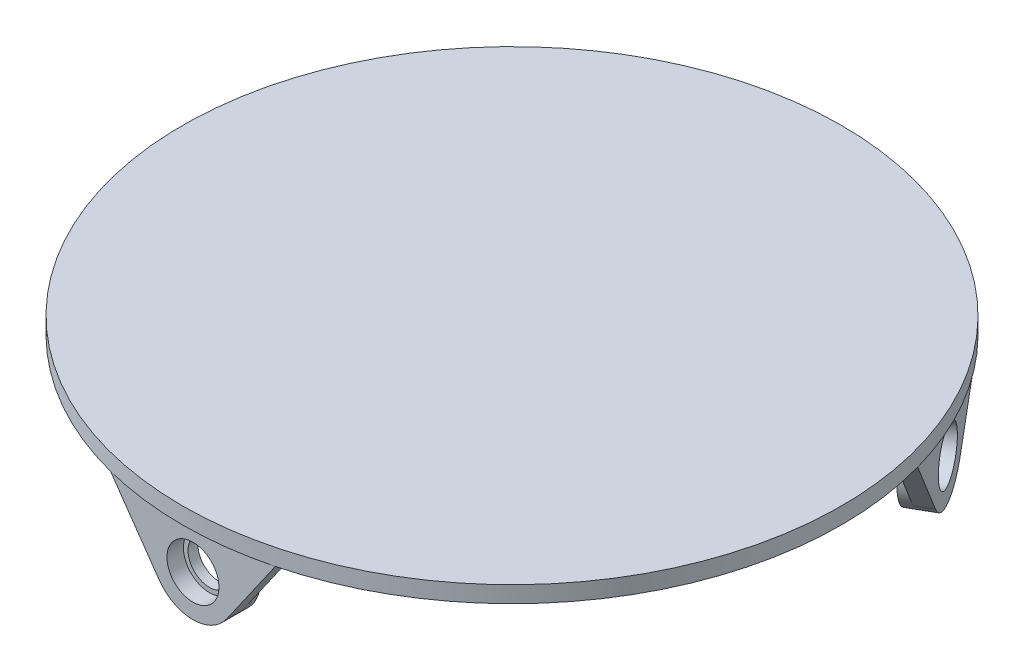
ISO-10303-21;
HEADER;
FILE_DESCRIPTION(('STEP AP214'),'2;1');
FILE_NAME('part.step','',(''),(''),'','','');
FILE_SCHEMA(('AUTOMOTIVE_DESIGN { 1 0 10303 214 1 1 1 1 }'));
ENDSEC;
DATA;
#1=APPLICATION_CONTEXT('core data for automotive mechanical design processes');
#2=APPLICATION_PROTOCOL_DEFINITION('international standard','automotive_design',2000,#1);
#3=PRODUCT_CONTEXT('',#1,'mechanical');
#4=PRODUCT('Part','Part','',(#3));
#5=PRODUCT_RELATED_PRODUCT_CATEGORY('part','',(#4));
#6=PRODUCT_DEFINITION_FORMATION('','',#4);
#7=PRODUCT_DEFINITION_CONTEXT('part definition',#1,'design');
#8=PRODUCT_DEFINITION('design','',#6,#7);
#9=PRODUCT_DEFINITION_SHAPE('','',#8);
#10=(LENGTH_UNIT() NAMED_UNIT(*) SI_UNIT(.MILLI.,.METRE.));
#11=(NAMED_UNIT(*) PLANE_ANGLE_UNIT() SI_UNIT($,.RADIAN.));
#12=(NAMED_UNIT(*) SI_UNIT($,.STERADIAN.) SOLID_ANGLE_UNIT());
#13=UNCERTAINTY_MEASURE_WITH_UNIT(LENGTH_MEASURE(1.E-05),#10,'distance_accuracy_value','');
#14=(GEOMETRIC_REPRESENTATION_CONTEXT(3) GLOBAL_UNCERTAINTY_ASSIGNED_CONTEXT((#13)) GLOBAL_UNIT_ASSIGNED_CONTEXT((#10,
#11,#12)) REPRESENTATION_CONTEXT('',''));
#15=CARTESIAN_POINT('',(0.,0.,0.));
#16=DIRECTION('',(0.,0.,1.));
#17=DIRECTION('',(1.,0.,0.));
#18=AXIS2_PLACEMENT_3D('',#15,#16,#17);
#19=CARTESIAN_POINT('',(0.,0.,0.));
#20=DIRECTION('',(0.,1.,0.));
#21=DIRECTION('',(0.,0.,1.));
#22=AXIS2_PLACEMENT_3D('',#19,#20,#21);
#23=PLANE('',#22);
#24=DIRECTION('',(-0.866025403784437,0.,0.500000000000003));
#25=VECTOR('',#24,1.);
#26=CARTESIAN_POINT('',(92.0224221373198,0.,-24.2616567329822));
#27=LINE('',#26,#25);
#28=CARTESIAN_POINT('',(96.352549156242,0.,-26.7616567329822));
#29=VERTEX_POINT('',#28);
#30=CARTESIAN_POINT('',(92.0224221373198,0.,-24.2616567329822));
#31=VERTEX_POINT('',#30);
#32=EDGE_CURVE('E196',#29,#31,#27,.T.);
#33=ORIENTED_EDGE('',*,*,#32,.F.);
#34=CARTESIAN_POINT('',(0.,0.,0.));
#35=DIRECTION('',(0.,1.,0.));
#36=DIRECTION('',(0.,0.,1.));
#37=AXIS2_PLACEMENT_3D('',#34,#35,#36);
#38=CIRCLE('',#37,100.);
#39=CARTESIAN_POINT('',(25.,0.,96.8245836551854));
#40=VERTEX_POINT('',#39);
#41=EDGE_CURVE('E49',#40,#29,#38,.T.);
#42=ORIENTED_EDGE('',*,*,#41,.F.);
#43=DIRECTION('',(0.,0.,1.));
#44=VECTOR('',#43,1.);
#45=CARTESIAN_POINT('',(25.,0.,96.8245836551854));
#46=LINE('',#45,#44);
#47=CARTESIAN_POINT('',(25.,0.,91.8245836551854));
#48=VERTEX_POINT('',#47);
#49=EDGE_CURVE('E259',#48,#40,#46,.T.);
#50=ORIENTED_EDGE('',*,*,#49,.F.);
#51=DIRECTION('',(1.,0.,0.));
#52=VECTOR('',#51,1.);
#53=CARTESIAN_POINT('',(25.,0.,91.8245836551854));
#54=LINE('',#53,#52);
#55=CARTESIAN_POINT('',(-25.,0.,91.8245836551854));
#56=VERTEX_POINT('',#55);
#57=EDGE_CURVE('E255',#56,#48,#54,.T.);
#58=ORIENTED_EDGE('',*,*,#57,.F.);
#59=DIRECTION('',(0.,0.,-1.));
#60=VECTOR('',#59,1.);
#61=CARTESIAN_POINT('',(-25.,0.,91.8245836551854));
#62=LINE('',#61,#60);
#63=CARTESIAN_POINT('',(-25.,0.,96.8245836551854));
#64=VERTEX_POINT('',#63);
#65=EDGE_CURVE('E249',#64,#56,#62,.T.);
#66=ORIENTED_EDGE('',*,*,#65,.F.);
#67=CARTESIAN_POINT('',(-96.3525491562423,0.,-26.7616567329808));
#68=VERTEX_POINT('',#67);
#69=EDGE_CURVE('E272',#68,#64,#38,.T.);
#70=ORIENTED_EDGE('',*,*,#69,.F.);
#71=DIRECTION('',(-0.866025403784443,0.,-0.499999999999993));
#72=VECTOR('',#71,1.);
#73=CARTESIAN_POINT('',(-96.3525491562424,0.,-26.7616567329808));
#74=LINE('',#73,#72);
#75=CARTESIAN_POINT('',(-92.0224221373201,0.,-24.2616567329809));
#76=VERTEX_POINT('',#75);
#77=EDGE_CURVE('E217',#76,#68,#74,.T.);
#78=ORIENTED_EDGE('',*,*,#77,.F.);
#79=DIRECTION('',(-0.499999999999992,0.,0.866025403784443));
#80=VECTOR('',#79,1.);
#81=CARTESIAN_POINT('',(-92.0224221373201,0.,-24.2616567329809));
#82=LINE('',#81,#80);
#83=CARTESIAN_POINT('',(-67.0224221373205,0.,-67.562926922203));
#84=VERTEX_POINT('',#83);
#85=EDGE_CURVE('E214',#84,#76,#82,.T.);
#86=ORIENTED_EDGE('',*,*,#85,.F.);
#87=DIRECTION('',(0.866025403784443,0.,0.499999999999993));
#88=VECTOR('',#87,1.);
#89=CARTESIAN_POINT('',(-67.0224221373205,0.,-67.562926922203));
#90=LINE('',#89,#88);
#91=CARTESIAN_POINT('',(-71.3525491562428,0.,-70.062926922203));
#92=VERTEX_POINT('',#91);
#93=EDGE_CURVE('E159',#92,#84,#90,.T.);
#94=ORIENTED_EDGE('',*,*,#93,.F.);
#95=CARTESIAN_POINT('',(71.3525491562418,0.,-70.062926922204));
#96=VERTEX_POINT('',#95);
#97=EDGE_CURVE('E283',#96,#92,#38,.T.);
#98=ORIENTED_EDGE('',*,*,#97,.F.);
#99=DIRECTION('',(0.866025403784437,0.,-0.500000000000003));
#100=VECTOR('',#99,1.);
#101=CARTESIAN_POINT('',(71.3525491562418,0.,-70.062926922204));
#102=LINE('',#101,#100);
#103=CARTESIAN_POINT('',(67.0224221373196,0.,-67.562926922204));
#104=VERTEX_POINT('',#103);
#105=EDGE_CURVE('E204',#104,#96,#102,.T.);
#106=ORIENTED_EDGE('',*,*,#105,.F.);
#107=DIRECTION('',(-0.500000000000004,0.,-0.866025403784436));
#108=VECTOR('',#107,1.);
#109=CARTESIAN_POINT('',(67.0224221373196,0.,-67.562926922204));
#110=LINE('',#109,#108);
#111=EDGE_CURVE('E199',#31,#104,#110,.T.);
#112=ORIENTED_EDGE('',*,*,#111,.F.);
#113=EDGE_LOOP('',(#33,#42,#50,#58,#66,#70,#78,#86,#94,#98,#106,#112));
#114=FACE_BOUND('',#113,.T.);
#115=ADVANCED_FACE('F45',(#114),#23,.F.);
#116=DIRECTION('',(0.500000000000004,0.,0.866025403784436));
#117=VECTOR('',#116,1.);
#118=CARTESIAN_POINT('',(96.352549156242,0.,-26.7616567329822));
#119=LINE('',#118,#117);
#120=EDGE_CURVE('E207',#96,#29,#119,.T.);
#121=ORIENTED_EDGE('',*,*,#120,.F.);
#122=EDGE_CURVE('E273',#29,#96,#38,.T.);
#123=ORIENTED_EDGE('',*,*,#122,.F.);
#124=EDGE_LOOP('',(#121,#123));
#125=FACE_BOUND('',#124,.T.);
#126=ADVANCED_FACE('F321',(#125),#23,.F.);
#127=DIRECTION('',(0.499999999999992,0.,-0.866025403784443));
#128=VECTOR('',#127,1.);
#129=CARTESIAN_POINT('',(-71.3525491562428,0.,-70.062926922203));
#130=LINE('',#129,#128);
#131=EDGE_CURVE('E200',#68,#92,#130,.T.);
#132=ORIENTED_EDGE('',*,*,#131,.F.);
#133=EDGE_CURVE('E279',#92,#68,#38,.T.);
#134=ORIENTED_EDGE('',*,*,#133,.F.);
#135=EDGE_LOOP('',(#132,#134));
#136=FACE_BOUND('',#135,.T.);
#137=ADVANCED_FACE('F294',(#136),#23,.F.);
#138=DIRECTION('',(-1.,0.,0.));
#139=VECTOR('',#138,1.);
#140=CARTESIAN_POINT('',(-25.,0.,96.8245836551854));
#141=LINE('',#140,#139);
#142=EDGE_CURVE('E262',#40,#64,#141,.T.);
#143=ORIENTED_EDGE('',*,*,#142,.F.);
#144=EDGE_CURVE('E265',#64,#40,#38,.T.);
#145=ORIENTED_EDGE('',*,*,#144,.F.);
#146=EDGE_LOOP('',(#143,#145));
#147=FACE_BOUND('',#146,.T.);
#148=ADVANCED_FACE('F311',(#147),#23,.F.);
#149=CARTESIAN_POINT('',(0.,5.,0.));
#150=DIRECTION('',(0.,-1.,0.));
#151=DIRECTION('',(0.,0.,-1.));
#152=AXIS2_PLACEMENT_3D('',#149,#150,#151);
#153=CYLINDRICAL_SURFACE('',#152,100.);
#154=CARTESIAN_POINT('',(0.,5.,0.));
#155=DIRECTION('',(0.,1.,0.));
#156=DIRECTION('',(0.,0.,1.));
#157=AXIS2_PLACEMENT_3D('',#154,#155,#156);
#158=CIRCLE('',#157,100.);
#159=CARTESIAN_POINT('',(0.,5.,100.));
#160=VERTEX_POINT('',#159);
#161=EDGE_CURVE('E11',#160,#160,#158,.T.);
#162=ORIENTED_EDGE('',*,*,#161,.F.);
#163=EDGE_LOOP('',(#162));
#164=FACE_BOUND('',#163,.T.);
#165=ORIENTED_EDGE('',*,*,#41,.T.);
#166=ORIENTED_EDGE('',*,*,#122,.T.);
#167=ORIENTED_EDGE('',*,*,#97,.T.);
#168=ORIENTED_EDGE('',*,*,#133,.T.);
#169=ORIENTED_EDGE('',*,*,#69,.T.);
#170=ORIENTED_EDGE('',*,*,#144,.T.);
#171=EDGE_LOOP('',(#165,#166,#167,#168,#169,#170));
#172=FACE_BOUND('',#171,.T.);
#173=ADVANCED_FACE('F47',(#164,#172),#153,.T.);
#174=CARTESIAN_POINT('',(0.,5.,0.));
#175=DIRECTION('',(0.,1.,0.));
#176=DIRECTION('',(0.,0.,1.));
#177=AXIS2_PLACEMENT_3D('',#174,#175,#176);
#178=PLANE('',#177);
#179=ORIENTED_EDGE('',*,*,#161,.T.);
#180=EDGE_LOOP('',(#179));
#181=FACE_BOUND('',#180,.T.);
#182=ADVANCED_FACE('F318',(#181),#178,.T.);
#183=CARTESIAN_POINT('',(25.,-30.,91.8245836551854));
#184=DIRECTION('',(0.,0.,1.));
#185=DIRECTION('',(1.,0.,0.));
#186=AXIS2_PLACEMENT_3D('',#183,#184,#185);
#187=PLANE('',#186);
#188=CARTESIAN_POINT('',(0.,-14.,91.8245836551854));
#189=DIRECTION('',(0.,0.,-1.));
#190=DIRECTION('',(-1.,0.,0.));
#191=AXIS2_PLACEMENT_3D('',#188,#189,#190);
#192=CIRCLE('',#191,12.5);
#193=CARTESIAN_POINT('',(-10.2536304257294,-21.1493400459453,91.8245836551854));
#194=VERTEX_POINT('',#193);
#195=CARTESIAN_POINT('',(10.2536304257294,-21.1493400459453,91.8245836551854));
#196=VERTEX_POINT('',#195);
#197=EDGE_CURVE('E350',#194,#196,#192,.T.);
#198=ORIENTED_EDGE('',*,*,#197,.F.);
#199=DIRECTION('',(0.571947203675623,-0.820290434058349,0.));
#200=VECTOR('',#199,1.);
#201=CARTESIAN_POINT('',(-25.,0.,91.8245836551854));
#202=LINE('',#201,#200);
#203=EDGE_CURVE('E237',#56,#194,#202,.T.);
#204=ORIENTED_EDGE('',*,*,#203,.F.);
#205=ORIENTED_EDGE('',*,*,#57,.T.);
#206=DIRECTION('',(0.571947203675623,0.820290434058349,0.));
#207=VECTOR('',#206,1.);
#208=CARTESIAN_POINT('',(25.,0.,91.8245836551854));
#209=LINE('',#208,#207);
#210=EDGE_CURVE('E241',#196,#48,#209,.T.);
#211=ORIENTED_EDGE('',*,*,#210,.F.);
#212=EDGE_LOOP('',(#198,#204,#205,#211));
#213=FACE_BOUND('',#212,.T.);
#214=ADVANCED_FACE('F349',(#213),#187,.F.);
#215=CARTESIAN_POINT('',(-25.,-30.,96.8245836551854));
#216=DIRECTION('',(0.,0.,-1.));
#217=DIRECTION('',(-1.,0.,0.));
#218=AXIS2_PLACEMENT_3D('',#215,#216,#217);
#219=PLANE('',#218);
#220=CARTESIAN_POINT('',(0.,-14.,96.8245836551854));
#221=DIRECTION('',(0.,0.,-1.));
#222=DIRECTION('',(-1.,0.,0.));
#223=AXIS2_PLACEMENT_3D('',#220,#221,#222);
#224=CIRCLE('',#223,7.89);
#225=CARTESIAN_POINT('',(-7.89,-14.,96.8245836551854));
#226=VERTEX_POINT('',#225);
#227=EDGE_CURVE('E211',#226,#226,#224,.F.);
#228=ORIENTED_EDGE('',*,*,#227,.F.);
#229=EDGE_LOOP('',(#228));
#230=FACE_BOUND('',#229,.T.);
#231=CARTESIAN_POINT('',(0.,-14.,96.8245836551854));
#232=DIRECTION('',(0.,0.,-1.));
#233=DIRECTION('',(-1.,0.,0.));
#234=AXIS2_PLACEMENT_3D('',#231,#232,#233);
#235=CIRCLE('',#234,12.5);
#236=CARTESIAN_POINT('',(10.2536304257294,-21.1493400459453,96.8245836551854));
#237=VERTEX_POINT('',#236);
#238=CARTESIAN_POINT('',(-10.2536304257294,-21.1493400459453,96.8245836551854));
#239=VERTEX_POINT('',#238);
#240=EDGE_CURVE('E230',#237,#239,#235,.T.);
#241=ORIENTED_EDGE('',*,*,#240,.F.);
#242=DIRECTION('',(-0.571947203675623,-0.820290434058349,0.));
#243=VECTOR('',#242,1.);
#244=CARTESIAN_POINT('',(25.,0.,96.8245836551854));
#245=LINE('',#244,#243);
#246=EDGE_CURVE('E233',#40,#237,#245,.T.);
#247=ORIENTED_EDGE('',*,*,#246,.F.);
#248=ORIENTED_EDGE('',*,*,#142,.T.);
#249=DIRECTION('',(-0.571947203675623,0.820290434058349,0.));
#250=VECTOR('',#249,1.);
#251=CARTESIAN_POINT('',(-25.,0.,96.8245836551854));
#252=LINE('',#251,#250);
#253=EDGE_CURVE('E226',#239,#64,#252,.T.);
#254=ORIENTED_EDGE('',*,*,#253,.F.);
#255=EDGE_LOOP('',(#241,#247,#248,#254));
#256=FACE_BOUND('',#255,.T.);
#257=ADVANCED_FACE('F355',(#230,#256),#219,.F.);
#258=CARTESIAN_POINT('',(25.,0.,100.001));
#259=DIRECTION('',(-0.820290434058349,0.571947203675623,0.));
#260=DIRECTION('',(-0.571947203675623,-0.820290434058349,0.));
#261=AXIS2_PLACEMENT_3D('',#258,#259,#260);
#262=PLANE('',#261);
#263=ORIENTED_EDGE('',*,*,#246,.T.);
#264=DIRECTION('',(0.,0.,-1.));
#265=VECTOR('',#264,1.);
#266=CARTESIAN_POINT('',(10.2536304257294,-21.1493400459453,100.001));
#267=LINE('',#266,#265);
#268=EDGE_CURVE('E245',#237,#196,#267,.T.);
#269=ORIENTED_EDGE('',*,*,#268,.T.);
#270=ORIENTED_EDGE('',*,*,#210,.T.);
#271=ORIENTED_EDGE('',*,*,#49,.T.);
#272=EDGE_LOOP('',(#263,#269,#270,#271));
#273=FACE_BOUND('',#272,.T.);
#274=ADVANCED_FACE('F358',(#273),#262,.F.);
#275=CARTESIAN_POINT('',(0.,-14.,100.001));
#276=DIRECTION('',(0.,0.,-1.));
#277=DIRECTION('',(-1.,0.,0.));
#278=AXIS2_PLACEMENT_3D('',#275,#276,#277);
#279=CYLINDRICAL_SURFACE('',#278,12.5);
#280=ORIENTED_EDGE('',*,*,#240,.T.);
#281=DIRECTION('',(0.,0.,-1.));
#282=VECTOR('',#281,1.);
#283=CARTESIAN_POINT('',(-10.2536304257294,-21.1493400459453,100.001));
#284=LINE('',#283,#282);
#285=EDGE_CURVE('E244',#239,#194,#284,.T.);
#286=ORIENTED_EDGE('',*,*,#285,.T.);
#287=ORIENTED_EDGE('',*,*,#197,.T.);
#288=ORIENTED_EDGE('',*,*,#268,.F.);
#289=EDGE_LOOP('',(#280,#286,#287,#288));
#290=FACE_BOUND('',#289,.T.);
#291=CARTESIAN_POINT('',(0.,-14.,88.8245836551854));
#292=DIRECTION('',(0.,0.,-1.));
#293=DIRECTION('',(-1.,0.,0.));
#294=AXIS2_PLACEMENT_3D('',#291,#292,#293);
#295=CIRCLE('',#294,12.5);
#296=CARTESIAN_POINT('',(-12.5,-14.,88.8245836551854));
#297=VERTEX_POINT('',#296);
#298=EDGE_CURVE('E647',#297,#297,#295,.T.);
#299=ORIENTED_EDGE('',*,*,#298,.F.);
#300=EDGE_LOOP('',(#299));
#301=FACE_BOUND('',#300,.T.);
#302=ADVANCED_FACE('F356',(#290,#301),#279,.T.);
#303=CARTESIAN_POINT('',(-25.,0.,100.001));
#304=DIRECTION('',(0.820290434058349,0.571947203675623,0.));
#305=DIRECTION('',(-0.571947203675623,0.820290434058349,0.));
#306=AXIS2_PLACEMENT_3D('',#303,#304,#305);
#307=PLANE('',#306);
#308=ORIENTED_EDGE('',*,*,#253,.T.);
#309=ORIENTED_EDGE('',*,*,#65,.T.);
#310=ORIENTED_EDGE('',*,*,#203,.T.);
#311=ORIENTED_EDGE('',*,*,#285,.F.);
#312=EDGE_LOOP('',(#308,#309,#310,#311));
#313=FACE_BOUND('',#312,.T.);
#314=ADVANCED_FACE('F352',(#313),#307,.F.);
#315=CARTESIAN_POINT('',(0.,-14.,100.001));
#316=DIRECTION('',(0.,0.,-1.));
#317=DIRECTION('',(-1.,0.,0.));
#318=AXIS2_PLACEMENT_3D('',#315,#316,#317);
#319=CYLINDRICAL_SURFACE('',#318,7.89);
#320=CARTESIAN_POINT('',(0.,-14.,91.8245836551854));
#321=DIRECTION('',(0.,0.,-1.));
#322=DIRECTION('',(-1.,0.,0.));
#323=AXIS2_PLACEMENT_3D('',#320,#321,#322);
#324=CIRCLE('',#323,7.89);
#325=CARTESIAN_POINT('',(-7.89,-14.,91.8245836551854));
#326=VERTEX_POINT('',#325);
#327=EDGE_CURVE('E644',#326,#326,#324,.F.);
#328=ORIENTED_EDGE('',*,*,#327,.F.);
#329=EDGE_LOOP('',(#328));
#330=FACE_BOUND('',#329,.T.);
#331=ORIENTED_EDGE('',*,*,#227,.T.);
#332=EDGE_LOOP('',(#331));
#333=FACE_BOUND('',#332,.T.);
#334=ADVANCED_FACE('F369',(#330,#333),#319,.F.);
#335=CARTESIAN_POINT('',(-92.0224221373201,-30.,-24.2616567329809));
#336=DIRECTION('',(-0.866025403784443,0.,-0.499999999999992));
#337=DIRECTION('',(-0.499999999999992,0.,0.866025403784443));
#338=AXIS2_PLACEMENT_3D('',#335,#336,#337);
#339=PLANE('',#338);
#340=CARTESIAN_POINT('',(-79.5224221373203,-14.,-45.912291827592));
#341=DIRECTION('',(0.866025403784443,0.,0.499999999999992));
#342=DIRECTION('',(0.499999999999992,0.,-0.866025403784443));
#343=AXIS2_PLACEMENT_3D('',#340,#341,#342);
#344=CIRCLE('',#343,12.5);
#345=CARTESIAN_POINT('',(-74.3956069244557,-21.1493400459453,-54.7921962572907));
#346=VERTEX_POINT('',#345);
#347=CARTESIAN_POINT('',(-84.6492373501849,-21.1493400459453,-37.0323873978932));
#348=VERTEX_POINT('',#347);
#349=EDGE_CURVE('E137',#346,#348,#344,.T.);
#350=ORIENTED_EDGE('',*,*,#349,.F.);
#351=DIRECTION('',(-0.285973601837807,-0.820290434058349,0.495320808006565));
#352=VECTOR('',#351,1.);
#353=CARTESIAN_POINT('',(-67.0224221373205,0.,-67.562926922203));
#354=LINE('',#353,#352);
#355=EDGE_CURVE('E141',#84,#346,#354,.T.);
#356=ORIENTED_EDGE('',*,*,#355,.F.);
#357=ORIENTED_EDGE('',*,*,#85,.T.);
#358=DIRECTION('',(-0.285973601837807,0.820290434058349,0.495320808006565));
#359=VECTOR('',#358,1.);
#360=CARTESIAN_POINT('',(-92.0224221373201,0.,-24.2616567329809));
#361=LINE('',#360,#359);
#362=EDGE_CURVE('E143',#348,#76,#361,.T.);
#363=ORIENTED_EDGE('',*,*,#362,.F.);
#364=EDGE_LOOP('',(#350,#356,#357,#363));
#365=FACE_BOUND('',#364,.T.);
#366=ADVANCED_FACE('F138',(#365),#339,.F.);
#367=CARTESIAN_POINT('',(-71.3525491562428,-30.,-70.062926922203));
#368=DIRECTION('',(0.866025403784443,0.,0.499999999999992));
#369=DIRECTION('',(0.499999999999992,0.,-0.866025403784443));
#370=AXIS2_PLACEMENT_3D('',#367,#368,#369);
#371=PLANE('',#370);
#372=CARTESIAN_POINT('',(-83.8525491562426,-14.,-48.4122918275919));
#373=DIRECTION('',(0.866025403784443,0.,0.499999999999992));
#374=DIRECTION('',(0.499999999999992,0.,-0.866025403784443));
#375=AXIS2_PLACEMENT_3D('',#372,#373,#374);
#376=CIRCLE('',#375,7.89);
#377=CARTESIAN_POINT('',(-79.9075491562426,-14.,-55.2452322634512));
#378=VERTEX_POINT('',#377);
#379=EDGE_CURVE('E646',#378,#378,#376,.F.);
#380=ORIENTED_EDGE('',*,*,#379,.F.);
#381=EDGE_LOOP('',(#380));
#382=FACE_BOUND('',#381,.T.);
#383=CARTESIAN_POINT('',(-83.8525491562426,-14.,-48.4122918275919));
#384=DIRECTION('',(0.866025403784443,0.,0.499999999999992));
#385=DIRECTION('',(0.499999999999992,0.,-0.866025403784443));
#386=AXIS2_PLACEMENT_3D('',#383,#384,#385);
#387=CIRCLE('',#386,12.5);
#388=CARTESIAN_POINT('',(-88.9793643691072,-21.1493400459453,-39.5323873978932));
#389=VERTEX_POINT('',#388);
#390=CARTESIAN_POINT('',(-78.725733943378,-21.1493400459453,-57.2921962572907));
#391=VERTEX_POINT('',#390);
#392=EDGE_CURVE('E61',#389,#391,#387,.T.);
#393=ORIENTED_EDGE('',*,*,#392,.F.);
#394=DIRECTION('',(0.285973601837807,-0.820290434058349,-0.495320808006565));
#395=VECTOR('',#394,1.);
#396=CARTESIAN_POINT('',(-96.3525491562424,0.,-26.7616567329808));
#397=LINE('',#396,#395);
#398=EDGE_CURVE('E161',#68,#389,#397,.T.);
#399=ORIENTED_EDGE('',*,*,#398,.F.);
#400=ORIENTED_EDGE('',*,*,#131,.T.);
#401=DIRECTION('',(0.285973601837807,0.820290434058349,-0.495320808006565));
#402=VECTOR('',#401,1.);
#403=CARTESIAN_POINT('',(-71.3525491562428,0.,-70.062926922203));
#404=LINE('',#403,#402);
#405=EDGE_CURVE('E302',#391,#92,#404,.T.);
#406=ORIENTED_EDGE('',*,*,#405,.F.);
#407=EDGE_LOOP('',(#393,#399,#400,#406));
#408=FACE_BOUND('',#407,.T.);
#409=ADVANCED_FACE('F301',(#382,#408),#371,.F.);
#410=CARTESIAN_POINT('',(67.0224221373196,-30.,-67.562926922204));
#411=DIRECTION('',(0.866025403784436,0.,-0.500000000000004));
#412=DIRECTION('',(-0.500000000000004,0.,-0.866025403784436));
#413=AXIS2_PLACEMENT_3D('',#410,#411,#412);
#414=PLANE('',#413);
#415=CARTESIAN_POINT('',(79.5224221373197,-14.,-45.9122918275931));
#416=DIRECTION('',(-0.866025403784436,0.,0.500000000000004));
#417=DIRECTION('',(0.500000000000004,0.,0.866025403784436));
#418=AXIS2_PLACEMENT_3D('',#415,#416,#417);
#419=CIRCLE('',#418,12.5);
#420=CARTESIAN_POINT('',(84.6492373501844,-21.1493400459453,-37.0323873978944));
#421=VERTEX_POINT('',#420);
#422=CARTESIAN_POINT('',(74.395606924455,-21.1493400459453,-54.7921962572917));
#423=VERTEX_POINT('',#422);
#424=EDGE_CURVE('E343',#421,#423,#419,.T.);
#425=ORIENTED_EDGE('',*,*,#424,.F.);
#426=DIRECTION('',(-0.285973601837814,-0.820290434058349,-0.495320808006561));
#427=VECTOR('',#426,1.);
#428=CARTESIAN_POINT('',(92.0224221373198,0.,-24.2616567329822));
#429=LINE('',#428,#427);
#430=EDGE_CURVE('E182',#31,#421,#429,.T.);
#431=ORIENTED_EDGE('',*,*,#430,.F.);
#432=ORIENTED_EDGE('',*,*,#111,.T.);
#433=DIRECTION('',(-0.285973601837814,0.820290434058349,-0.495320808006561));
#434=VECTOR('',#433,1.);
#435=CARTESIAN_POINT('',(67.0224221373196,0.,-67.562926922204));
#436=LINE('',#435,#434);
#437=EDGE_CURVE('E186',#423,#104,#436,.T.);
#438=ORIENTED_EDGE('',*,*,#437,.F.);
#439=EDGE_LOOP('',(#425,#431,#432,#438));
#440=FACE_BOUND('',#439,.T.);
#441=ADVANCED_FACE('F342',(#440),#414,.F.);
#442=CARTESIAN_POINT('',(96.352549156242,-30.,-26.7616567329822));
#443=DIRECTION('',(-0.866025403784436,0.,0.500000000000004));
#444=DIRECTION('',(0.500000000000004,0.,0.866025403784436));
#445=AXIS2_PLACEMENT_3D('',#442,#443,#444);
#446=PLANE('',#445);
#447=CARTESIAN_POINT('',(83.8525491562419,-14.,-48.4122918275931));
#448=DIRECTION('',(-0.866025403784436,0.,0.500000000000004));
#449=DIRECTION('',(0.500000000000004,0.,0.866025403784436));
#450=AXIS2_PLACEMENT_3D('',#447,#448,#449);
#451=CIRCLE('',#450,7.89);
#452=CARTESIAN_POINT('',(87.797549156242,-14.,-41.5793513917339));
#453=VERTEX_POINT('',#452);
#454=EDGE_CURVE('E171',#453,#453,#451,.F.);
#455=ORIENTED_EDGE('',*,*,#454,.F.);
#456=EDGE_LOOP('',(#455));
#457=FACE_BOUND('',#456,.T.);
#458=CARTESIAN_POINT('',(83.8525491562419,-14.,-48.4122918275931));
#459=DIRECTION('',(-0.866025403784436,0.,0.500000000000004));
#460=DIRECTION('',(0.500000000000004,0.,0.866025403784436));
#461=AXIS2_PLACEMENT_3D('',#458,#459,#460);
#462=CIRCLE('',#461,12.5);
#463=CARTESIAN_POINT('',(78.7257339433772,-21.1493400459453,-57.2921962572918));
#464=VERTEX_POINT('',#463);
#465=CARTESIAN_POINT('',(88.9793643691066,-21.1493400459453,-39.5323873978945));
#466=VERTEX_POINT('',#465);
#467=EDGE_CURVE('E69',#464,#466,#462,.T.);
#468=ORIENTED_EDGE('',*,*,#467,.F.);
#469=DIRECTION('',(0.285973601837814,-0.820290434058349,0.495320808006561));
#470=VECTOR('',#469,1.);
#471=CARTESIAN_POINT('',(71.3525491562418,0.,-70.062926922204));
#472=LINE('',#471,#470);
#473=EDGE_CURVE('E178',#96,#464,#472,.T.);
#474=ORIENTED_EDGE('',*,*,#473,.F.);
#475=ORIENTED_EDGE('',*,*,#120,.T.);
#476=DIRECTION('',(0.285973601837814,0.820290434058349,0.495320808006561));
#477=VECTOR('',#476,1.);
#478=CARTESIAN_POINT('',(96.352549156242,0.,-26.7616567329822));
#479=LINE('',#478,#477);
#480=EDGE_CURVE('E173',#466,#29,#479,.T.);
#481=ORIENTED_EDGE('',*,*,#480,.F.);
#482=EDGE_LOOP('',(#468,#474,#475,#481));
#483=FACE_BOUND('',#482,.T.);
#484=ADVANCED_FACE('F335',(#457,#483),#446,.F.);
#485=CARTESIAN_POINT('',(105.802453201924,0.,-89.9525882965354));
#486=DIRECTION('',(0.410145217029178,0.571947203675624,0.710392354375892));
#487=DIRECTION('',(0.,-0.778921706529271,0.627121180552474));
#488=AXIS2_PLACEMENT_3D('',#485,#486,#487);
#489=PLANE('',#488);
#490=ORIENTED_EDGE('',*,*,#473,.T.);
#491=DIRECTION('',(-0.866025403784436,0.,0.500000000000004));
#492=VECTOR('',#491,1.);
#493=CARTESIAN_POINT('',(113.175637989059,-21.1493400459453,-77.1818576316231));
#494=LINE('',#493,#492);
#495=EDGE_CURVE('E190',#464,#423,#494,.T.);
#496=ORIENTED_EDGE('',*,*,#495,.T.);
#497=ORIENTED_EDGE('',*,*,#437,.T.);
#498=ORIENTED_EDGE('',*,*,#105,.T.);
#499=EDGE_LOOP('',(#490,#496,#497,#498));
#500=FACE_BOUND('',#499,.T.);
#501=ADVANCED_FACE('F337',(#500),#489,.F.);
#502=CARTESIAN_POINT('',(118.302453201924,-14.,-68.3019532019245));
#503=DIRECTION('',(-0.866025403784436,0.,0.500000000000004));
#504=DIRECTION('',(0.500000000000004,0.,0.866025403784436));
#505=AXIS2_PLACEMENT_3D('',#502,#503,#504);
#506=CYLINDRICAL_SURFACE('',#505,12.5);
#507=ORIENTED_EDGE('',*,*,#467,.T.);
#508=DIRECTION('',(-0.866025403784436,0.,0.500000000000004));
#509=VECTOR('',#508,1.);
#510=CARTESIAN_POINT('',(123.429268414788,-21.1493400459453,-59.4220487722258));
#511=LINE('',#510,#509);
#512=EDGE_CURVE('E189',#466,#421,#511,.T.);
#513=ORIENTED_EDGE('',*,*,#512,.T.);
#514=ORIENTED_EDGE('',*,*,#424,.T.);
#515=ORIENTED_EDGE('',*,*,#495,.F.);
#516=EDGE_LOOP('',(#507,#513,#514,#515));
#517=FACE_BOUND('',#516,.T.);
#518=CARTESIAN_POINT('',(76.9243459259664,-14.,-44.4122918275931));
#519=DIRECTION('',(-0.866025403784436,0.,0.500000000000004));
#520=DIRECTION('',(0.500000000000004,0.,0.866025403784436));
#521=AXIS2_PLACEMENT_3D('',#518,#519,#520);
#522=CIRCLE('',#521,12.5);
#523=CARTESIAN_POINT('',(83.1743459259664,-14.,-33.5869742802876));
#524=VERTEX_POINT('',#523);
#525=EDGE_CURVE('E679',#524,#524,#522,.T.);
#526=ORIENTED_EDGE('',*,*,#525,.F.);
#527=EDGE_LOOP('',(#526));
#528=FACE_BOUND('',#527,.T.);
#529=ADVANCED_FACE('F486',(#517,#528),#506,.T.);
#530=CARTESIAN_POINT('',(130.802453201924,0.,-46.6513181073136));
#531=DIRECTION('',(-0.410145217029178,0.571947203675624,-0.710392354375892));
#532=DIRECTION('',(0.,0.778921706529271,0.627121180552474));
#533=AXIS2_PLACEMENT_3D('',#530,#531,#532);
#534=PLANE('',#533);
#535=ORIENTED_EDGE('',*,*,#480,.T.);
#536=ORIENTED_EDGE('',*,*,#32,.T.);
#537=ORIENTED_EDGE('',*,*,#430,.T.);
#538=ORIENTED_EDGE('',*,*,#512,.F.);
#539=EDGE_LOOP('',(#535,#536,#537,#538));
#540=FACE_BOUND('',#539,.T.);
#541=ADVANCED_FACE('F345',(#540),#534,.F.);
#542=CARTESIAN_POINT('',(118.302453201924,-14.,-68.3019532019245));
#543=DIRECTION('',(-0.866025403784436,0.,0.500000000000004));
#544=DIRECTION('',(0.500000000000004,0.,0.866025403784436));
#545=AXIS2_PLACEMENT_3D('',#542,#543,#544);
#546=CYLINDRICAL_SURFACE('',#545,7.89);
#547=CARTESIAN_POINT('',(79.5224221373197,-14.,-45.9122918275931));
#548=DIRECTION('',(-0.866025403784436,0.,0.500000000000004));
#549=DIRECTION('',(0.500000000000004,0.,0.866025403784436));
#550=AXIS2_PLACEMENT_3D('',#547,#548,#549);
#551=CIRCLE('',#550,7.89);
#552=CARTESIAN_POINT('',(83.4674221373198,-14.,-39.0793513917339));
#553=VERTEX_POINT('',#552);
#554=EDGE_CURVE('E669',#553,#553,#551,.F.);
#555=ORIENTED_EDGE('',*,*,#554,.F.);
#556=EDGE_LOOP('',(#555));
#557=FACE_BOUND('',#556,.T.);
#558=ORIENTED_EDGE('',*,*,#454,.T.);
#559=EDGE_LOOP('',(#558));
#560=FACE_BOUND('',#559,.T.);
#561=ADVANCED_FACE('F507',(#557,#560),#546,.F.);
#562=CARTESIAN_POINT('',(-118.302453201924,-14.,-68.3019532019226));
#563=DIRECTION('',(0.866025403784443,0.,0.499999999999992));
#564=DIRECTION('',(0.499999999999992,0.,-0.866025403784443));
#565=AXIS2_PLACEMENT_3D('',#562,#563,#564);
#566=CYLINDRICAL_SURFACE('',#565,7.89);
#567=CARTESIAN_POINT('',(-79.5224221373203,-14.,-45.912291827592));
#568=DIRECTION('',(0.866025403784443,0.,0.499999999999992));
#569=DIRECTION('',(0.499999999999992,0.,-0.866025403784443));
#570=AXIS2_PLACEMENT_3D('',#567,#568,#569);
#571=CIRCLE('',#570,7.89);
#572=CARTESIAN_POINT('',(-75.5774221373204,-14.,-52.7452322634512));
#573=VERTEX_POINT('',#572);
#574=EDGE_CURVE('E676',#573,#573,#571,.F.);
#575=ORIENTED_EDGE('',*,*,#574,.F.);
#576=EDGE_LOOP('',(#575));
#577=FACE_BOUND('',#576,.T.);
#578=ORIENTED_EDGE('',*,*,#379,.T.);
#579=EDGE_LOOP('',(#578));
#580=FACE_BOUND('',#579,.T.);
#581=ADVANCED_FACE('F516',(#577,#580),#566,.F.);
#582=CARTESIAN_POINT('',(-130.802453201924,0.,-46.6513181073115));
#583=DIRECTION('',(0.410145217029168,0.571947203675623,-0.710392354375898));
#584=DIRECTION('',(0.,0.778921706529273,0.627121180552471));
#585=AXIS2_PLACEMENT_3D('',#582,#583,#584);
#586=PLANE('',#585);
#587=ORIENTED_EDGE('',*,*,#398,.T.);
#588=DIRECTION('',(0.866025403784443,0.,0.499999999999992));
#589=VECTOR('',#588,1.);
#590=CARTESIAN_POINT('',(-123.429268414789,-21.1493400459453,-59.4220487722238));
#591=LINE('',#590,#589);
#592=EDGE_CURVE('E155',#389,#348,#591,.T.);
#593=ORIENTED_EDGE('',*,*,#592,.T.);
#594=ORIENTED_EDGE('',*,*,#362,.T.);
#595=ORIENTED_EDGE('',*,*,#77,.T.);
#596=EDGE_LOOP('',(#587,#593,#594,#595));
#597=FACE_BOUND('',#596,.T.);
#598=ADVANCED_FACE('F304',(#597),#586,.F.);
#599=CARTESIAN_POINT('',(-118.302453201924,-14.,-68.3019532019226));
#600=DIRECTION('',(0.866025403784443,0.,0.499999999999992));
#601=DIRECTION('',(0.499999999999992,0.,-0.866025403784443));
#602=AXIS2_PLACEMENT_3D('',#599,#600,#601);
#603=CYLINDRICAL_SURFACE('',#602,12.5);
#604=ORIENTED_EDGE('',*,*,#392,.T.);
#605=DIRECTION('',(0.866025403784443,0.,0.499999999999992));
#606=VECTOR('',#605,1.);
#607=CARTESIAN_POINT('',(-113.17563798906,-21.1493400459453,-77.1818576316213));
#608=LINE('',#607,#606);
#609=EDGE_CURVE('E149',#391,#346,#608,.T.);
#610=ORIENTED_EDGE('',*,*,#609,.T.);
#611=ORIENTED_EDGE('',*,*,#349,.T.);
#612=ORIENTED_EDGE('',*,*,#592,.F.);
#613=EDGE_LOOP('',(#604,#610,#611,#612));
#614=FACE_BOUND('',#613,.T.);
#615=CARTESIAN_POINT('',(-76.924345925967,-14.,-44.412291827592));
#616=DIRECTION('',(0.866025403784443,0.,0.499999999999992));
#617=DIRECTION('',(0.499999999999992,0.,-0.866025403784443));
#618=AXIS2_PLACEMENT_3D('',#615,#616,#617);
#619=CIRCLE('',#618,12.5);
#620=CARTESIAN_POINT('',(-70.6743459259671,-14.,-55.2376093748975));
#621=VERTEX_POINT('',#620);
#622=EDGE_CURVE('E146',#621,#621,#619,.T.);
#623=ORIENTED_EDGE('',*,*,#622,.F.);
#624=EDGE_LOOP('',(#623));
#625=FACE_BOUND('',#624,.T.);
#626=ADVANCED_FACE('F150',(#614,#625),#603,.T.);
#627=CARTESIAN_POINT('',(-105.802453201924,0.,-89.9525882965336));
#628=DIRECTION('',(-0.410145217029168,0.571947203675623,0.710392354375898));
#629=DIRECTION('',(0.,-0.778921706529273,0.627121180552471));
#630=AXIS2_PLACEMENT_3D('',#627,#628,#629);
#631=PLANE('',#630);
#632=ORIENTED_EDGE('',*,*,#405,.T.);
#633=ORIENTED_EDGE('',*,*,#93,.T.);
#634=ORIENTED_EDGE('',*,*,#355,.T.);
#635=ORIENTED_EDGE('',*,*,#609,.F.);
#636=EDGE_LOOP('',(#632,#633,#634,#635));
#637=FACE_BOUND('',#636,.T.);
#638=ADVANCED_FACE('F157',(#637),#631,.F.);
#639=CARTESIAN_POINT('',(0.,-14.,91.8245836551854));
#640=DIRECTION('',(0.,0.,-1.));
#641=DIRECTION('',(-1.,0.,0.));
#642=AXIS2_PLACEMENT_3D('',#639,#640,#641);
#643=PLANE('',#642);
#644=CARTESIAN_POINT('',(0.,-14.,91.8245836551854));
#645=DIRECTION('',(0.,0.,-1.));
#646=DIRECTION('',(-1.,0.,0.));
#647=AXIS2_PLACEMENT_3D('',#644,#645,#646);
#648=CIRCLE('',#647,6.5);
#649=CARTESIAN_POINT('',(-6.5,-14.,91.8245836551854));
#650=VERTEX_POINT('',#649);
#651=EDGE_CURVE('E641',#650,#650,#648,.T.);
#652=ORIENTED_EDGE('',*,*,#651,.T.);
#653=EDGE_LOOP('',(#652));
#654=FACE_BOUND('',#653,.T.);
#655=ORIENTED_EDGE('',*,*,#327,.T.);
#656=EDGE_LOOP('',(#655));
#657=FACE_BOUND('',#656,.T.);
#658=ADVANCED_FACE('F549',(#654,#657),#643,.F.);
#659=CARTESIAN_POINT('',(0.,-14.,88.8245836551854));
#660=DIRECTION('',(0.,0.,-1.));
#661=DIRECTION('',(-1.,0.,0.));
#662=AXIS2_PLACEMENT_3D('',#659,#660,#661);
#663=PLANE('',#662);
#664=ORIENTED_EDGE('',*,*,#298,.T.);
#665=EDGE_LOOP('',(#664));
#666=FACE_BOUND('',#665,.T.);
#667=CARTESIAN_POINT('',(0.,-14.,88.8245836551854));
#668=DIRECTION('',(0.,0.,-1.));
#669=DIRECTION('',(-1.,0.,0.));
#670=AXIS2_PLACEMENT_3D('',#667,#668,#669);
#671=CIRCLE('',#670,6.5);
#672=CARTESIAN_POINT('',(-6.5,-14.,88.8245836551854));
#673=VERTEX_POINT('',#672);
#674=EDGE_CURVE('E665',#673,#673,#671,.T.);
#675=ORIENTED_EDGE('',*,*,#674,.F.);
#676=EDGE_LOOP('',(#675));
#677=FACE_BOUND('',#676,.T.);
#678=ADVANCED_FACE('F618',(#666,#677),#663,.T.);
#679=CARTESIAN_POINT('',(0.,-14.,88.8245836551854));
#680=DIRECTION('',(0.,0.,1.));
#681=DIRECTION('',(1.,0.,0.));
#682=AXIS2_PLACEMENT_3D('',#679,#680,#681);
#683=CYLINDRICAL_SURFACE('',#682,6.5);
#684=ORIENTED_EDGE('',*,*,#674,.T.);
#685=EDGE_LOOP('',(#684));
#686=FACE_BOUND('',#685,.T.);
#687=ORIENTED_EDGE('',*,*,#651,.F.);
#688=EDGE_LOOP('',(#687));
#689=FACE_BOUND('',#688,.T.);
#690=ADVANCED_FACE('F560',(#686,#689),#683,.F.);
#691=CARTESIAN_POINT('',(-79.5224221373203,-14.,-45.912291827592));
#692=DIRECTION('',(0.866025403784443,0.,0.499999999999992));
#693=DIRECTION('',(0.499999999999992,0.,-0.866025403784443));
#694=AXIS2_PLACEMENT_3D('',#691,#692,#693);
#695=PLANE('',#694);
#696=CARTESIAN_POINT('',(-79.5224221373203,-14.,-45.912291827592));
#697=DIRECTION('',(0.866025403784443,0.,0.499999999999992));
#698=DIRECTION('',(0.499999999999992,0.,-0.866025403784443));
#699=AXIS2_PLACEMENT_3D('',#696,#697,#698);
#700=CIRCLE('',#699,6.5);
#701=CARTESIAN_POINT('',(-76.2724221373204,-14.,-51.5414569521909));
#702=VERTEX_POINT('',#701);
#703=EDGE_CURVE('E685',#702,#702,#700,.T.);
#704=ORIENTED_EDGE('',*,*,#703,.T.);
#705=EDGE_LOOP('',(#704));
#706=FACE_BOUND('',#705,.T.);
#707=ORIENTED_EDGE('',*,*,#574,.T.);
#708=EDGE_LOOP('',(#707));
#709=FACE_BOUND('',#708,.T.);
#710=ADVANCED_FACE('F556',(#706,#709),#695,.F.);
#711=CARTESIAN_POINT('',(-76.924345925967,-14.,-44.412291827592));
#712=DIRECTION('',(0.866025403784443,0.,0.499999999999992));
#713=DIRECTION('',(0.499999999999992,0.,-0.866025403784443));
#714=AXIS2_PLACEMENT_3D('',#711,#712,#713);
#715=PLANE('',#714);
#716=ORIENTED_EDGE('',*,*,#622,.T.);
#717=EDGE_LOOP('',(#716));
#718=FACE_BOUND('',#717,.T.);
#719=CARTESIAN_POINT('',(-76.924345925967,-14.,-44.412291827592));
#720=DIRECTION('',(0.866025403784443,0.,0.499999999999992));
#721=DIRECTION('',(0.499999999999992,0.,-0.866025403784443));
#722=AXIS2_PLACEMENT_3D('',#719,#720,#721);
#723=CIRCLE('',#722,6.5);
#724=CARTESIAN_POINT('',(-73.6743459259671,-14.,-50.0414569521909));
#725=VERTEX_POINT('',#724);
#726=EDGE_CURVE('E147',#725,#725,#723,.T.);
#727=ORIENTED_EDGE('',*,*,#726,.F.);
#728=EDGE_LOOP('',(#727));
#729=FACE_BOUND('',#728,.T.);
#730=ADVANCED_FACE('F559',(#718,#729),#715,.T.);
#731=CARTESIAN_POINT('',(-76.924345925967,-14.,-44.412291827592));
#732=DIRECTION('',(-0.866025403784443,0.,-0.499999999999992));
#733=DIRECTION('',(-0.499999999999992,0.,0.866025403784443));
#734=AXIS2_PLACEMENT_3D('',#731,#732,#733);
#735=CYLINDRICAL_SURFACE('',#734,6.5);
#736=ORIENTED_EDGE('',*,*,#726,.T.);
#737=EDGE_LOOP('',(#736));
#738=FACE_BOUND('',#737,.T.);
#739=ORIENTED_EDGE('',*,*,#703,.F.);
#740=EDGE_LOOP('',(#739));
#741=FACE_BOUND('',#740,.T.);
#742=ADVANCED_FACE('F569',(#738,#741),#735,.F.);
#743=CARTESIAN_POINT('',(79.5224221373197,-14.,-45.9122918275931));
#744=DIRECTION('',(-0.866025403784436,0.,0.500000000000004));
#745=DIRECTION('',(0.500000000000004,0.,0.866025403784436));
#746=AXIS2_PLACEMENT_3D('',#743,#744,#745);
#747=PLANE('',#746);
#748=CARTESIAN_POINT('',(79.5224221373197,-14.,-45.9122918275931));
#749=DIRECTION('',(-0.866025403784436,0.,0.500000000000004));
#750=DIRECTION('',(0.500000000000004,0.,0.866025403784436));
#751=AXIS2_PLACEMENT_3D('',#748,#749,#750);
#752=CIRCLE('',#751,6.5);
#753=CARTESIAN_POINT('',(82.7724221373198,-14.,-40.2831267029942));
#754=VERTEX_POINT('',#753);
#755=EDGE_CURVE('E684',#754,#754,#752,.T.);
#756=ORIENTED_EDGE('',*,*,#755,.T.);
#757=EDGE_LOOP('',(#756));
#758=FACE_BOUND('',#757,.T.);
#759=ORIENTED_EDGE('',*,*,#554,.T.);
#760=EDGE_LOOP('',(#759));
#761=FACE_BOUND('',#760,.T.);
#762=ADVANCED_FACE('F578',(#758,#761),#747,.F.);
#763=CARTESIAN_POINT('',(76.9243459259664,-14.,-44.4122918275931));
#764=DIRECTION('',(-0.866025403784436,0.,0.500000000000004));
#765=DIRECTION('',(0.500000000000004,0.,0.866025403784436));
#766=AXIS2_PLACEMENT_3D('',#763,#764,#765);
#767=PLANE('',#766);
#768=ORIENTED_EDGE('',*,*,#525,.T.);
#769=EDGE_LOOP('',(#768));
#770=FACE_BOUND('',#769,.T.);
#771=CARTESIAN_POINT('',(76.9243459259664,-14.,-44.4122918275931));
#772=DIRECTION('',(-0.866025403784436,0.,0.500000000000004));
#773=DIRECTION('',(0.500000000000004,0.,0.866025403784436));
#774=AXIS2_PLACEMENT_3D('',#771,#772,#773);
#775=CIRCLE('',#774,6.5);
#776=CARTESIAN_POINT('',(80.1743459259664,-14.,-38.7831267029942));
#777=VERTEX_POINT('',#776);
#778=EDGE_CURVE('E694',#777,#777,#775,.T.);
#779=ORIENTED_EDGE('',*,*,#778,.F.);
#780=EDGE_LOOP('',(#779));
#781=FACE_BOUND('',#780,.T.);
#782=ADVANCED_FACE('F587',(#770,#781),#767,.T.);
#783=CARTESIAN_POINT('',(76.9243459259664,-14.,-44.4122918275931));
#784=DIRECTION('',(0.866025403784436,0.,-0.500000000000004));
#785=DIRECTION('',(-0.500000000000004,0.,-0.866025403784436));
#786=AXIS2_PLACEMENT_3D('',#783,#784,#785);
#787=CYLINDRICAL_SURFACE('',#786,6.5);
#788=ORIENTED_EDGE('',*,*,#778,.T.);
#789=EDGE_LOOP('',(#788));
#790=FACE_BOUND('',#789,.T.);
#791=ORIENTED_EDGE('',*,*,#755,.F.);
#792=EDGE_LOOP('',(#791));
#793=FACE_BOUND('',#792,.T.);
#794=ADVANCED_FACE('F596',(#790,#793),#787,.F.);
#795=CLOSED_SHELL('',(#115,#126,#137,#148,#173,#182,#214,#257,#274,#302,#314,#334,#366,#409,
#441,#484,#501,#529,#541,#561,#581,#598,#626,#638,#658,#678,#690,#710,#730,#742,#762,#782,#794));
#796=MANIFOLD_SOLID_BREP('B2',#795);
#797=ADVANCED_BREP_SHAPE_REPRESENTATION('',(#18,#796),#14);
#798=SHAPE_DEFINITION_REPRESENTATION(#9,#797);
ENDSEC;
END-ISO-10303-21;
